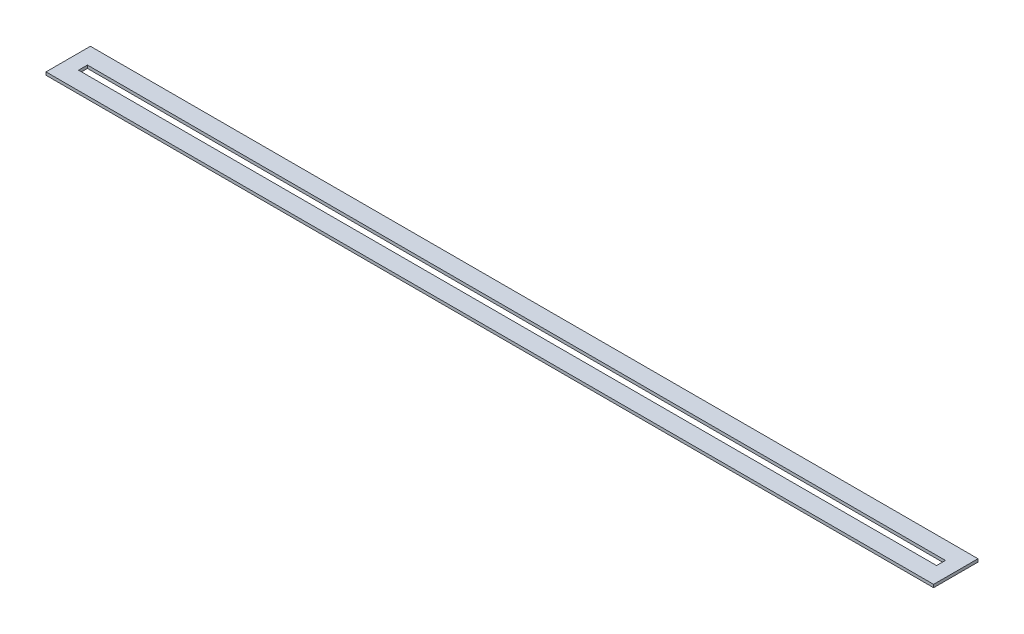
ISO-10303-21;
HEADER;
FILE_DESCRIPTION(('STEP AP214'),'2;1');
FILE_NAME('part.step','',(''),(''),'','','');
FILE_SCHEMA(('AUTOMOTIVE_DESIGN { 1 0 10303 214 1 1 1 1 }'));
ENDSEC;
DATA;
#1=APPLICATION_CONTEXT('core data for automotive mechanical design processes');
#2=APPLICATION_PROTOCOL_DEFINITION('international standard','automotive_design',2000,#1);
#3=PRODUCT_CONTEXT('',#1,'mechanical');
#4=PRODUCT('Part','Part','',(#3));
#5=PRODUCT_RELATED_PRODUCT_CATEGORY('part','',(#4));
#6=PRODUCT_DEFINITION_FORMATION('','',#4);
#7=PRODUCT_DEFINITION_CONTEXT('part definition',#1,'design');
#8=PRODUCT_DEFINITION('design','',#6,#7);
#9=PRODUCT_DEFINITION_SHAPE('','',#8);
#10=(LENGTH_UNIT() NAMED_UNIT(*) SI_UNIT(.MILLI.,.METRE.));
#11=(NAMED_UNIT(*) PLANE_ANGLE_UNIT() SI_UNIT($,.RADIAN.));
#12=(NAMED_UNIT(*) SI_UNIT($,.STERADIAN.) SOLID_ANGLE_UNIT());
#13=UNCERTAINTY_MEASURE_WITH_UNIT(LENGTH_MEASURE(1.E-05),#10,'distance_accuracy_value','');
#14=(GEOMETRIC_REPRESENTATION_CONTEXT(3) GLOBAL_UNCERTAINTY_ASSIGNED_CONTEXT((#13)) GLOBAL_UNIT_ASSIGNED_CONTEXT((#10,
#11,#12)) REPRESENTATION_CONTEXT('',''));
#15=CARTESIAN_POINT('',(0.,0.,0.));
#16=DIRECTION('',(0.,0.,1.));
#17=DIRECTION('',(1.,0.,0.));
#18=AXIS2_PLACEMENT_3D('',#15,#16,#17);
#19=CARTESIAN_POINT('',(0.,2.,30.));
#20=DIRECTION('',(0.,1.,0.));
#21=DIRECTION('',(0.,0.,1.));
#22=AXIS2_PLACEMENT_3D('',#19,#20,#21);
#23=PLANE('',#22);
#24=DIRECTION('',(0.,0.,1.));
#25=VECTOR('',#24,1.);
#26=CARTESIAN_POINT('',(0.,2.,0.));
#27=LINE('',#26,#25);
#28=CARTESIAN_POINT('',(0.,2.,0.));
#29=VERTEX_POINT('',#28);
#30=CARTESIAN_POINT('',(0.,2.,30.));
#31=VERTEX_POINT('',#30);
#32=EDGE_CURVE('E135',#29,#31,#27,.T.);
#33=ORIENTED_EDGE('',*,*,#32,.T.);
#34=DIRECTION('',(1.,0.,0.));
#35=VECTOR('',#34,1.);
#36=CARTESIAN_POINT('',(0.,2.,30.));
#37=LINE('',#36,#35);
#38=CARTESIAN_POINT('',(600.,2.,30.));
#39=VERTEX_POINT('',#38);
#40=EDGE_CURVE('E138',#31,#39,#37,.T.);
#41=ORIENTED_EDGE('',*,*,#40,.T.);
#42=DIRECTION('',(0.,0.,-1.));
#43=VECTOR('',#42,1.);
#44=CARTESIAN_POINT('',(600.,2.,0.));
#45=LINE('',#44,#43);
#46=CARTESIAN_POINT('',(600.,2.,0.));
#47=VERTEX_POINT('',#46);
#48=EDGE_CURVE('E141',#39,#47,#45,.T.);
#49=ORIENTED_EDGE('',*,*,#48,.T.);
#50=DIRECTION('',(-1.,0.,0.));
#51=VECTOR('',#50,1.);
#52=CARTESIAN_POINT('',(0.,2.,0.));
#53=LINE('',#52,#51);
#54=EDGE_CURVE('E143',#47,#29,#53,.T.);
#55=ORIENTED_EDGE('',*,*,#54,.T.);
#56=EDGE_LOOP('',(#33,#41,#49,#55));
#57=FACE_BOUND('',#56,.T.);
#58=DIRECTION('',(-1.,0.,0.));
#59=VECTOR('',#58,1.);
#60=CARTESIAN_POINT('',(10.,2.,12.));
#61=LINE('',#60,#59);
#62=CARTESIAN_POINT('',(590.,2.,12.));
#63=VERTEX_POINT('',#62);
#64=CARTESIAN_POINT('',(10.,2.,12.));
#65=VERTEX_POINT('',#64);
#66=EDGE_CURVE('E107',#63,#65,#61,.T.);
#67=ORIENTED_EDGE('',*,*,#66,.F.);
#68=DIRECTION('',(0.,0.,-1.));
#69=VECTOR('',#68,1.);
#70=CARTESIAN_POINT('',(590.,2.,12.));
#71=LINE('',#70,#69);
#72=CARTESIAN_POINT('',(590.,2.,18.));
#73=VERTEX_POINT('',#72);
#74=EDGE_CURVE('E99',#73,#63,#71,.T.);
#75=ORIENTED_EDGE('',*,*,#74,.F.);
#76=DIRECTION('',(1.,0.,0.));
#77=VECTOR('',#76,1.);
#78=CARTESIAN_POINT('',(10.,2.,18.));
#79=LINE('',#78,#77);
#80=CARTESIAN_POINT('',(10.,2.,18.));
#81=VERTEX_POINT('',#80);
#82=EDGE_CURVE('E121',#81,#73,#79,.T.);
#83=ORIENTED_EDGE('',*,*,#82,.F.);
#84=DIRECTION('',(0.,0.,1.));
#85=VECTOR('',#84,1.);
#86=CARTESIAN_POINT('',(10.,2.,12.));
#87=LINE('',#86,#85);
#88=EDGE_CURVE('E119',#65,#81,#87,.T.);
#89=ORIENTED_EDGE('',*,*,#88,.F.);
#90=EDGE_LOOP('',(#67,#75,#83,#89));
#91=FACE_BOUND('',#90,.T.);
#92=ADVANCED_FACE('F34',(#57,#91),#23,.T.);
#93=CARTESIAN_POINT('',(0.,0.,30.));
#94=DIRECTION('',(0.,1.,0.));
#95=DIRECTION('',(0.,0.,1.));
#96=AXIS2_PLACEMENT_3D('',#93,#94,#95);
#97=PLANE('',#96);
#98=DIRECTION('',(0.,0.,1.));
#99=VECTOR('',#98,1.);
#100=CARTESIAN_POINT('',(0.,0.,0.));
#101=LINE('',#100,#99);
#102=CARTESIAN_POINT('',(0.,0.,0.));
#103=VERTEX_POINT('',#102);
#104=CARTESIAN_POINT('',(0.,0.,30.));
#105=VERTEX_POINT('',#104);
#106=EDGE_CURVE('E115',#103,#105,#101,.T.);
#107=ORIENTED_EDGE('',*,*,#106,.F.);
#108=DIRECTION('',(-1.,0.,0.));
#109=VECTOR('',#108,1.);
#110=CARTESIAN_POINT('',(0.,0.,0.));
#111=LINE('',#110,#109);
#112=CARTESIAN_POINT('',(600.,0.,0.));
#113=VERTEX_POINT('',#112);
#114=EDGE_CURVE('E139',#113,#103,#111,.T.);
#115=ORIENTED_EDGE('',*,*,#114,.F.);
#116=DIRECTION('',(0.,0.,-1.));
#117=VECTOR('',#116,1.);
#118=CARTESIAN_POINT('',(600.,0.,0.));
#119=LINE('',#118,#117);
#120=CARTESIAN_POINT('',(600.,0.,30.));
#121=VERTEX_POINT('',#120);
#122=EDGE_CURVE('E150',#121,#113,#119,.T.);
#123=ORIENTED_EDGE('',*,*,#122,.F.);
#124=DIRECTION('',(1.,0.,0.));
#125=VECTOR('',#124,1.);
#126=CARTESIAN_POINT('',(0.,0.,30.));
#127=LINE('',#126,#125);
#128=EDGE_CURVE('E148',#105,#121,#127,.T.);
#129=ORIENTED_EDGE('',*,*,#128,.F.);
#130=EDGE_LOOP('',(#107,#115,#123,#129));
#131=FACE_BOUND('',#130,.T.);
#132=DIRECTION('',(0.,0.,-1.));
#133=VECTOR('',#132,1.);
#134=CARTESIAN_POINT('',(590.,0.,12.));
#135=LINE('',#134,#133);
#136=CARTESIAN_POINT('',(590.,0.,18.));
#137=VERTEX_POINT('',#136);
#138=CARTESIAN_POINT('',(590.,0.,12.));
#139=VERTEX_POINT('',#138);
#140=EDGE_CURVE('E57',#137,#139,#135,.T.);
#141=ORIENTED_EDGE('',*,*,#140,.T.);
#142=DIRECTION('',(-1.,0.,0.));
#143=VECTOR('',#142,1.);
#144=CARTESIAN_POINT('',(10.,0.,12.));
#145=LINE('',#144,#143);
#146=CARTESIAN_POINT('',(10.,0.,12.));
#147=VERTEX_POINT('',#146);
#148=EDGE_CURVE('E114',#139,#147,#145,.T.);
#149=ORIENTED_EDGE('',*,*,#148,.T.);
#150=DIRECTION('',(0.,0.,1.));
#151=VECTOR('',#150,1.);
#152=CARTESIAN_POINT('',(10.,0.,12.));
#153=LINE('',#152,#151);
#154=CARTESIAN_POINT('',(10.,0.,18.));
#155=VERTEX_POINT('',#154);
#156=EDGE_CURVE('E127',#147,#155,#153,.T.);
#157=ORIENTED_EDGE('',*,*,#156,.T.);
#158=DIRECTION('',(1.,0.,0.));
#159=VECTOR('',#158,1.);
#160=CARTESIAN_POINT('',(10.,0.,18.));
#161=LINE('',#160,#159);
#162=EDGE_CURVE('E108',#155,#137,#161,.T.);
#163=ORIENTED_EDGE('',*,*,#162,.T.);
#164=EDGE_LOOP('',(#141,#149,#157,#163));
#165=FACE_BOUND('',#164,.T.);
#166=ADVANCED_FACE('F168',(#131,#165),#97,.F.);
#167=CARTESIAN_POINT('',(0.,2.,0.));
#168=DIRECTION('',(1.,0.,0.));
#169=DIRECTION('',(0.,0.,-1.));
#170=AXIS2_PLACEMENT_3D('',#167,#168,#169);
#171=PLANE('',#170);
#172=ORIENTED_EDGE('',*,*,#106,.T.);
#173=DIRECTION('',(0.,-1.,0.));
#174=VECTOR('',#173,1.);
#175=CARTESIAN_POINT('',(0.,2.,30.));
#176=LINE('',#175,#174);
#177=EDGE_CURVE('E11',#31,#105,#176,.T.);
#178=ORIENTED_EDGE('',*,*,#177,.F.);
#179=ORIENTED_EDGE('',*,*,#32,.F.);
#180=DIRECTION('',(0.,-1.,0.));
#181=VECTOR('',#180,1.);
#182=CARTESIAN_POINT('',(0.,2.,0.));
#183=LINE('',#182,#181);
#184=EDGE_CURVE('E145',#29,#103,#183,.T.);
#185=ORIENTED_EDGE('',*,*,#184,.T.);
#186=EDGE_LOOP('',(#172,#178,#179,#185));
#187=FACE_BOUND('',#186,.T.);
#188=ADVANCED_FACE('F36',(#187),#171,.F.);
#189=CARTESIAN_POINT('',(0.,2.,30.));
#190=DIRECTION('',(0.,0.,-1.));
#191=DIRECTION('',(-1.,0.,0.));
#192=AXIS2_PLACEMENT_3D('',#189,#190,#191);
#193=PLANE('',#192);
#194=ORIENTED_EDGE('',*,*,#128,.T.);
#195=DIRECTION('',(0.,-1.,0.));
#196=VECTOR('',#195,1.);
#197=CARTESIAN_POINT('',(600.,2.,30.));
#198=LINE('',#197,#196);
#199=EDGE_CURVE('E42',#39,#121,#198,.T.);
#200=ORIENTED_EDGE('',*,*,#199,.F.);
#201=ORIENTED_EDGE('',*,*,#40,.F.);
#202=ORIENTED_EDGE('',*,*,#177,.T.);
#203=EDGE_LOOP('',(#194,#200,#201,#202));
#204=FACE_BOUND('',#203,.T.);
#205=ADVANCED_FACE('F178',(#204),#193,.F.);
#206=CARTESIAN_POINT('',(600.,2.,0.));
#207=DIRECTION('',(-1.,0.,0.));
#208=DIRECTION('',(0.,0.,1.));
#209=AXIS2_PLACEMENT_3D('',#206,#207,#208);
#210=PLANE('',#209);
#211=ORIENTED_EDGE('',*,*,#122,.T.);
#212=DIRECTION('',(0.,-1.,0.));
#213=VECTOR('',#212,1.);
#214=CARTESIAN_POINT('',(600.,2.,0.));
#215=LINE('',#214,#213);
#216=EDGE_CURVE('E155',#47,#113,#215,.T.);
#217=ORIENTED_EDGE('',*,*,#216,.F.);
#218=ORIENTED_EDGE('',*,*,#48,.F.);
#219=ORIENTED_EDGE('',*,*,#199,.T.);
#220=EDGE_LOOP('',(#211,#217,#218,#219));
#221=FACE_BOUND('',#220,.T.);
#222=ADVANCED_FACE('F162',(#221),#210,.F.);
#223=CARTESIAN_POINT('',(0.,2.,0.));
#224=DIRECTION('',(0.,0.,1.));
#225=DIRECTION('',(1.,0.,0.));
#226=AXIS2_PLACEMENT_3D('',#223,#224,#225);
#227=PLANE('',#226);
#228=ORIENTED_EDGE('',*,*,#114,.T.);
#229=ORIENTED_EDGE('',*,*,#184,.F.);
#230=ORIENTED_EDGE('',*,*,#54,.F.);
#231=ORIENTED_EDGE('',*,*,#216,.T.);
#232=EDGE_LOOP('',(#228,#229,#230,#231));
#233=FACE_BOUND('',#232,.T.);
#234=ADVANCED_FACE('F172',(#233),#227,.F.);
#235=CARTESIAN_POINT('',(590.,2.,12.));
#236=DIRECTION('',(-1.,0.,0.));
#237=DIRECTION('',(0.,0.,1.));
#238=AXIS2_PLACEMENT_3D('',#235,#236,#237);
#239=PLANE('',#238);
#240=ORIENTED_EDGE('',*,*,#140,.F.);
#241=DIRECTION('',(0.,-1.,0.));
#242=VECTOR('',#241,1.);
#243=CARTESIAN_POINT('',(590.,2.,18.));
#244=LINE('',#243,#242);
#245=EDGE_CURVE('E103',#73,#137,#244,.T.);
#246=ORIENTED_EDGE('',*,*,#245,.F.);
#247=ORIENTED_EDGE('',*,*,#74,.T.);
#248=DIRECTION('',(0.,-1.,0.));
#249=VECTOR('',#248,1.);
#250=CARTESIAN_POINT('',(590.,2.,12.));
#251=LINE('',#250,#249);
#252=EDGE_CURVE('E102',#63,#139,#251,.T.);
#253=ORIENTED_EDGE('',*,*,#252,.T.);
#254=EDGE_LOOP('',(#240,#246,#247,#253));
#255=FACE_BOUND('',#254,.T.);
#256=ADVANCED_FACE('F101',(#255),#239,.T.);
#257=CARTESIAN_POINT('',(10.,2.,12.));
#258=DIRECTION('',(0.,0.,1.));
#259=DIRECTION('',(1.,0.,0.));
#260=AXIS2_PLACEMENT_3D('',#257,#258,#259);
#261=PLANE('',#260);
#262=ORIENTED_EDGE('',*,*,#148,.F.);
#263=ORIENTED_EDGE('',*,*,#252,.F.);
#264=ORIENTED_EDGE('',*,*,#66,.T.);
#265=DIRECTION('',(0.,-1.,0.));
#266=VECTOR('',#265,1.);
#267=CARTESIAN_POINT('',(10.,2.,12.));
#268=LINE('',#267,#266);
#269=EDGE_CURVE('E116',#65,#147,#268,.T.);
#270=ORIENTED_EDGE('',*,*,#269,.T.);
#271=EDGE_LOOP('',(#262,#263,#264,#270));
#272=FACE_BOUND('',#271,.T.);
#273=ADVANCED_FACE('F111',(#272),#261,.T.);
#274=CARTESIAN_POINT('',(10.,2.,12.));
#275=DIRECTION('',(1.,0.,0.));
#276=DIRECTION('',(0.,0.,-1.));
#277=AXIS2_PLACEMENT_3D('',#274,#275,#276);
#278=PLANE('',#277);
#279=ORIENTED_EDGE('',*,*,#156,.F.);
#280=ORIENTED_EDGE('',*,*,#269,.F.);
#281=ORIENTED_EDGE('',*,*,#88,.T.);
#282=DIRECTION('',(0.,-1.,0.));
#283=VECTOR('',#282,1.);
#284=CARTESIAN_POINT('',(10.,2.,18.));
#285=LINE('',#284,#283);
#286=EDGE_CURVE('E49',#81,#155,#285,.T.);
#287=ORIENTED_EDGE('',*,*,#286,.T.);
#288=EDGE_LOOP('',(#279,#280,#281,#287));
#289=FACE_BOUND('',#288,.T.);
#290=ADVANCED_FACE('F201',(#289),#278,.T.);
#291=CARTESIAN_POINT('',(10.,2.,18.));
#292=DIRECTION('',(0.,0.,-1.));
#293=DIRECTION('',(-1.,0.,0.));
#294=AXIS2_PLACEMENT_3D('',#291,#292,#293);
#295=PLANE('',#294);
#296=ORIENTED_EDGE('',*,*,#162,.F.);
#297=ORIENTED_EDGE('',*,*,#286,.F.);
#298=ORIENTED_EDGE('',*,*,#82,.T.);
#299=ORIENTED_EDGE('',*,*,#245,.T.);
#300=EDGE_LOOP('',(#296,#297,#298,#299));
#301=FACE_BOUND('',#300,.T.);
#302=ADVANCED_FACE('F205',(#301),#295,.T.);
#303=CLOSED_SHELL('',(#92,#166,#188,#205,#222,#234,#256,#273,#290,#302));
#304=MANIFOLD_SOLID_BREP('B2',#303);
#305=ADVANCED_BREP_SHAPE_REPRESENTATION('',(#18,#304),#14);
#306=SHAPE_DEFINITION_REPRESENTATION(#9,#305);
ENDSEC;
END-ISO-10303-21;
